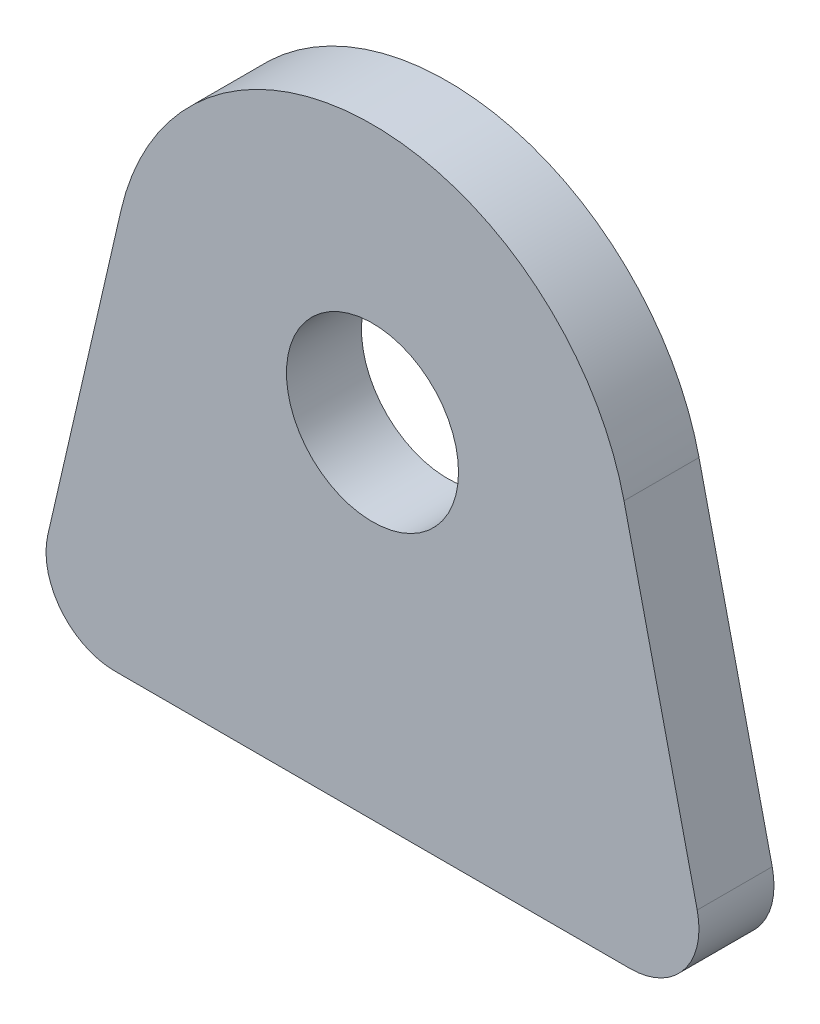
ISO-10303-21;
HEADER;
FILE_DESCRIPTION(('STEP AP214'),'2;1');
FILE_NAME('part.step','',(''),(''),'','','');
FILE_SCHEMA(('AUTOMOTIVE_DESIGN { 1 0 10303 214 1 1 1 1 }'));
ENDSEC;
DATA;
#1=APPLICATION_CONTEXT('core data for automotive mechanical design processes');
#2=APPLICATION_PROTOCOL_DEFINITION('international standard','automotive_design',2000,#1);
#3=PRODUCT_CONTEXT('',#1,'mechanical');
#4=PRODUCT('Part','Part','',(#3));
#5=PRODUCT_RELATED_PRODUCT_CATEGORY('part','',(#4));
#6=PRODUCT_DEFINITION_FORMATION('','',#4);
#7=PRODUCT_DEFINITION_CONTEXT('part definition',#1,'design');
#8=PRODUCT_DEFINITION('design','',#6,#7);
#9=PRODUCT_DEFINITION_SHAPE('','',#8);
#10=(LENGTH_UNIT() NAMED_UNIT(*) SI_UNIT(.MILLI.,.METRE.));
#11=(NAMED_UNIT(*) PLANE_ANGLE_UNIT() SI_UNIT($,.RADIAN.));
#12=(NAMED_UNIT(*) SI_UNIT($,.STERADIAN.) SOLID_ANGLE_UNIT());
#13=UNCERTAINTY_MEASURE_WITH_UNIT(LENGTH_MEASURE(1.E-05),#10,'distance_accuracy_value','');
#14=(GEOMETRIC_REPRESENTATION_CONTEXT(3) GLOBAL_UNCERTAINTY_ASSIGNED_CONTEXT((#13)) GLOBAL_UNIT_ASSIGNED_CONTEXT((#10,
#11,#12)) REPRESENTATION_CONTEXT('',''));
#15=CARTESIAN_POINT('',(0.,0.,0.));
#16=DIRECTION('',(0.,0.,1.));
#17=DIRECTION('',(1.,0.,0.));
#18=AXIS2_PLACEMENT_3D('',#15,#16,#17);
#19=CARTESIAN_POINT('',(-9.50836970439796,2.54,1.3843));
#20=DIRECTION('',(0.,0.,1.));
#21=DIRECTION('',(1.,0.,0.));
#22=AXIS2_PLACEMENT_3D('',#19,#20,#21);
#23=PLANE('',#22);
#24=CARTESIAN_POINT('',(-9.50836970439796,2.54,1.3843));
#25=DIRECTION('',(0.,0.,1.));
#26=DIRECTION('',(1.,0.,0.));
#27=AXIS2_PLACEMENT_3D('',#24,#25,#26);
#28=CIRCLE('',#27,2.54);
#29=CARTESIAN_POINT('',(-11.9835462130497,3.11017650865179,1.3843));
#30=VERTEX_POINT('',#29);
#31=CARTESIAN_POINT('',(-9.50836970439796,0.,1.3843));
#32=VERTEX_POINT('',#31);
#33=EDGE_CURVE('E129',#30,#32,#28,.T.);
#34=ORIENTED_EDGE('',*,*,#33,.T.);
#35=DIRECTION('',(1.,0.,0.));
#36=VECTOR('',#35,1.);
#37=CARTESIAN_POINT('',(-9.50836970439796,0.,1.3843));
#38=LINE('',#37,#36);
#39=CARTESIAN_POINT('',(9.50836970439796,0.,1.3843));
#40=VERTEX_POINT('',#39);
#41=EDGE_CURVE('E87',#32,#40,#38,.T.);
#42=ORIENTED_EDGE('',*,*,#41,.T.);
#43=CARTESIAN_POINT('',(9.50836970439796,2.54,1.3843));
#44=DIRECTION('',(0.,0.,1.));
#45=DIRECTION('',(1.,0.,0.));
#46=AXIS2_PLACEMENT_3D('',#43,#44,#45);
#47=CIRCLE('',#46,2.54);
#48=CARTESIAN_POINT('',(11.9835462130497,3.11017650865179,1.3843));
#49=VERTEX_POINT('',#48);
#50=EDGE_CURVE('E100',#40,#49,#47,.T.);
#51=ORIENTED_EDGE('',*,*,#50,.T.);
#52=DIRECTION('',(-0.22447894041409,0.97447894041409,0.));
#53=VECTOR('',#52,1.);
#54=CARTESIAN_POINT('',(9.28191190744421,14.8381619074442,1.3843));
#55=LINE('',#54,#53);
#56=CARTESIAN_POINT('',(9.28191190744421,14.8381619074442,1.3843));
#57=VERTEX_POINT('',#56);
#58=EDGE_CURVE('E94',#49,#57,#55,.T.);
#59=ORIENTED_EDGE('',*,*,#58,.T.);
#60=CARTESIAN_POINT('',(0.,12.7,1.3843));
#61=DIRECTION('',(0.,0.,1.));
#62=DIRECTION('',(1.,0.,0.));
#63=AXIS2_PLACEMENT_3D('',#60,#61,#62);
#64=CIRCLE('',#63,9.525);
#65=CARTESIAN_POINT('',(-9.28191190744421,14.8381619074442,1.3843));
#66=VERTEX_POINT('',#65);
#67=EDGE_CURVE('E98',#57,#66,#64,.T.);
#68=ORIENTED_EDGE('',*,*,#67,.T.);
#69=DIRECTION('',(-0.22447894041409,-0.97447894041409,0.));
#70=VECTOR('',#69,1.);
#71=CARTESIAN_POINT('',(-9.28191190744421,14.8381619074442,1.3843));
#72=LINE('',#71,#70);
#73=EDGE_CURVE('E50',#66,#30,#72,.T.);
#74=ORIENTED_EDGE('',*,*,#73,.T.);
#75=EDGE_LOOP('',(#34,#42,#51,#59,#68,#74));
#76=FACE_BOUND('',#75,.T.);
#77=CARTESIAN_POINT('',(0.,12.7,1.3843));
#78=DIRECTION('',(0.,0.,1.));
#79=DIRECTION('',(1.,0.,0.));
#80=AXIS2_PLACEMENT_3D('',#77,#78,#79);
#81=CIRCLE('',#80,3.175);
#82=CARTESIAN_POINT('',(3.175,12.7,1.3843));
#83=VERTEX_POINT('',#82);
#84=EDGE_CURVE('E122',#83,#83,#81,.T.);
#85=ORIENTED_EDGE('',*,*,#84,.F.);
#86=EDGE_LOOP('',(#85));
#87=FACE_BOUND('',#86,.T.);
#88=ADVANCED_FACE('F33',(#76,#87),#23,.T.);
#89=CARTESIAN_POINT('',(-9.50836970439796,2.54,-1.3843));
#90=DIRECTION('',(0.,0.,1.));
#91=DIRECTION('',(1.,0.,0.));
#92=AXIS2_PLACEMENT_3D('',#89,#90,#91);
#93=PLANE('',#92);
#94=CARTESIAN_POINT('',(-9.50836970439796,2.54,-1.3843));
#95=DIRECTION('',(0.,0.,1.));
#96=DIRECTION('',(1.,0.,0.));
#97=AXIS2_PLACEMENT_3D('',#94,#95,#96);
#98=CIRCLE('',#97,2.54);
#99=CARTESIAN_POINT('',(-11.9835462130497,3.11017650865179,-1.3843));
#100=VERTEX_POINT('',#99);
#101=CARTESIAN_POINT('',(-9.50836970439796,0.,-1.3843));
#102=VERTEX_POINT('',#101);
#103=EDGE_CURVE('E118',#100,#102,#98,.T.);
#104=ORIENTED_EDGE('',*,*,#103,.F.);
#105=DIRECTION('',(-0.22447894041409,-0.97447894041409,0.));
#106=VECTOR('',#105,1.);
#107=CARTESIAN_POINT('',(-9.28191190744421,14.8381619074442,-1.3843));
#108=LINE('',#107,#106);
#109=CARTESIAN_POINT('',(-9.28191190744421,14.8381619074442,-1.3843));
#110=VERTEX_POINT('',#109);
#111=EDGE_CURVE('E79',#110,#100,#108,.T.);
#112=ORIENTED_EDGE('',*,*,#111,.F.);
#113=CARTESIAN_POINT('',(0.,12.7,-1.3843));
#114=DIRECTION('',(0.,0.,1.));
#115=DIRECTION('',(1.,0.,0.));
#116=AXIS2_PLACEMENT_3D('',#113,#114,#115);
#117=CIRCLE('',#116,9.525);
#118=CARTESIAN_POINT('',(9.28191190744421,14.8381619074442,-1.3843));
#119=VERTEX_POINT('',#118);
#120=EDGE_CURVE('E73',#119,#110,#117,.T.);
#121=ORIENTED_EDGE('',*,*,#120,.F.);
#122=DIRECTION('',(-0.22447894041409,0.97447894041409,0.));
#123=VECTOR('',#122,1.);
#124=CARTESIAN_POINT('',(9.28191190744421,14.8381619074442,-1.3843));
#125=LINE('',#124,#123);
#126=CARTESIAN_POINT('',(11.9835462130497,3.11017650865179,-1.3843));
#127=VERTEX_POINT('',#126);
#128=EDGE_CURVE('E108',#127,#119,#125,.T.);
#129=ORIENTED_EDGE('',*,*,#128,.F.);
#130=CARTESIAN_POINT('',(9.50836970439796,2.54,-1.3843));
#131=DIRECTION('',(0.,0.,1.));
#132=DIRECTION('',(1.,0.,0.));
#133=AXIS2_PLACEMENT_3D('',#130,#131,#132);
#134=CIRCLE('',#133,2.54);
#135=CARTESIAN_POINT('',(9.50836970439796,0.,-1.3843));
#136=VERTEX_POINT('',#135);
#137=EDGE_CURVE('E124',#136,#127,#134,.T.);
#138=ORIENTED_EDGE('',*,*,#137,.F.);
#139=DIRECTION('',(1.,0.,0.));
#140=VECTOR('',#139,1.);
#141=CARTESIAN_POINT('',(-9.50836970439796,0.,-1.3843));
#142=LINE('',#141,#140);
#143=EDGE_CURVE('E121',#102,#136,#142,.T.);
#144=ORIENTED_EDGE('',*,*,#143,.F.);
#145=EDGE_LOOP('',(#104,#112,#121,#129,#138,#144));
#146=FACE_BOUND('',#145,.T.);
#147=CARTESIAN_POINT('',(0.,12.7,-1.3843));
#148=DIRECTION('',(0.,0.,1.));
#149=DIRECTION('',(1.,0.,0.));
#150=AXIS2_PLACEMENT_3D('',#147,#148,#149);
#151=CIRCLE('',#150,3.175);
#152=CARTESIAN_POINT('',(3.175,12.7,-1.3843));
#153=VERTEX_POINT('',#152);
#154=EDGE_CURVE('E222',#153,#153,#151,.T.);
#155=ORIENTED_EDGE('',*,*,#154,.T.);
#156=EDGE_LOOP('',(#155));
#157=FACE_BOUND('',#156,.T.);
#158=ADVANCED_FACE('F138',(#146,#157),#93,.F.);
#159=CARTESIAN_POINT('',(-9.50836970439796,2.54,1.3843));
#160=DIRECTION('',(0.,0.,-1.));
#161=DIRECTION('',(-1.,0.,0.));
#162=AXIS2_PLACEMENT_3D('',#159,#160,#161);
#163=CYLINDRICAL_SURFACE('',#162,2.54);
#164=ORIENTED_EDGE('',*,*,#103,.T.);
#165=DIRECTION('',(0.,0.,-1.));
#166=VECTOR('',#165,1.);
#167=CARTESIAN_POINT('',(-9.50836970439796,0.,1.3843));
#168=LINE('',#167,#166);
#169=EDGE_CURVE('E11',#32,#102,#168,.T.);
#170=ORIENTED_EDGE('',*,*,#169,.F.);
#171=ORIENTED_EDGE('',*,*,#33,.F.);
#172=DIRECTION('',(0.,0.,-1.));
#173=VECTOR('',#172,1.);
#174=CARTESIAN_POINT('',(-11.9835462130497,3.11017650865179,1.3843));
#175=LINE('',#174,#173);
#176=EDGE_CURVE('E114',#30,#100,#175,.T.);
#177=ORIENTED_EDGE('',*,*,#176,.T.);
#178=EDGE_LOOP('',(#164,#170,#171,#177));
#179=FACE_BOUND('',#178,.T.);
#180=ADVANCED_FACE('F35',(#179),#163,.T.);
#181=CARTESIAN_POINT('',(-9.50836970439796,0.,1.3843));
#182=DIRECTION('',(0.,1.,0.));
#183=DIRECTION('',(0.,0.,1.));
#184=AXIS2_PLACEMENT_3D('',#181,#182,#183);
#185=PLANE('',#184);
#186=ORIENTED_EDGE('',*,*,#143,.T.);
#187=DIRECTION('',(0.,0.,-1.));
#188=VECTOR('',#187,1.);
#189=CARTESIAN_POINT('',(9.50836970439796,0.,1.3843));
#190=LINE('',#189,#188);
#191=EDGE_CURVE('E42',#40,#136,#190,.T.);
#192=ORIENTED_EDGE('',*,*,#191,.F.);
#193=ORIENTED_EDGE('',*,*,#41,.F.);
#194=ORIENTED_EDGE('',*,*,#169,.T.);
#195=EDGE_LOOP('',(#186,#192,#193,#194));
#196=FACE_BOUND('',#195,.T.);
#197=ADVANCED_FACE('F163',(#196),#185,.F.);
#198=CARTESIAN_POINT('',(9.50836970439796,2.54,1.3843));
#199=DIRECTION('',(0.,0.,-1.));
#200=DIRECTION('',(-1.,0.,0.));
#201=AXIS2_PLACEMENT_3D('',#198,#199,#200);
#202=CYLINDRICAL_SURFACE('',#201,2.54);
#203=ORIENTED_EDGE('',*,*,#137,.T.);
#204=DIRECTION('',(0.,0.,-1.));
#205=VECTOR('',#204,1.);
#206=CARTESIAN_POINT('',(11.9835462130497,3.11017650865179,1.3843));
#207=LINE('',#206,#205);
#208=EDGE_CURVE('E109',#49,#127,#207,.T.);
#209=ORIENTED_EDGE('',*,*,#208,.F.);
#210=ORIENTED_EDGE('',*,*,#50,.F.);
#211=ORIENTED_EDGE('',*,*,#191,.T.);
#212=EDGE_LOOP('',(#203,#209,#210,#211));
#213=FACE_BOUND('',#212,.T.);
#214=ADVANCED_FACE('F135',(#213),#202,.T.);
#215=CARTESIAN_POINT('',(9.28191190744421,14.8381619074442,1.3843));
#216=DIRECTION('',(-0.97447894041409,-0.22447894041409,0.));
#217=DIRECTION('',(0.22447894041409,-0.97447894041409,0.));
#218=AXIS2_PLACEMENT_3D('',#215,#216,#217);
#219=PLANE('',#218);
#220=ORIENTED_EDGE('',*,*,#128,.T.);
#221=DIRECTION('',(0.,0.,-1.));
#222=VECTOR('',#221,1.);
#223=CARTESIAN_POINT('',(9.28191190744421,14.8381619074442,1.3843));
#224=LINE('',#223,#222);
#225=EDGE_CURVE('E105',#57,#119,#224,.T.);
#226=ORIENTED_EDGE('',*,*,#225,.F.);
#227=ORIENTED_EDGE('',*,*,#58,.F.);
#228=ORIENTED_EDGE('',*,*,#208,.T.);
#229=EDGE_LOOP('',(#220,#226,#227,#228));
#230=FACE_BOUND('',#229,.T.);
#231=ADVANCED_FACE('F106',(#230),#219,.F.);
#232=CARTESIAN_POINT('',(0.,12.7,1.3843));
#233=DIRECTION('',(0.,0.,-1.));
#234=DIRECTION('',(-1.,0.,0.));
#235=AXIS2_PLACEMENT_3D('',#232,#233,#234);
#236=CYLINDRICAL_SURFACE('',#235,9.525);
#237=ORIENTED_EDGE('',*,*,#120,.T.);
#238=DIRECTION('',(0.,0.,-1.));
#239=VECTOR('',#238,1.);
#240=CARTESIAN_POINT('',(-9.28191190744421,14.8381619074442,1.3843));
#241=LINE('',#240,#239);
#242=EDGE_CURVE('E110',#66,#110,#241,.T.);
#243=ORIENTED_EDGE('',*,*,#242,.F.);
#244=ORIENTED_EDGE('',*,*,#67,.F.);
#245=ORIENTED_EDGE('',*,*,#225,.T.);
#246=EDGE_LOOP('',(#237,#243,#244,#245));
#247=FACE_BOUND('',#246,.T.);
#248=ADVANCED_FACE('F112',(#247),#236,.T.);
#249=CARTESIAN_POINT('',(-9.28191190744421,14.8381619074442,1.3843));
#250=DIRECTION('',(0.97447894041409,-0.22447894041409,0.));
#251=DIRECTION('',(0.22447894041409,0.97447894041409,0.));
#252=AXIS2_PLACEMENT_3D('',#249,#250,#251);
#253=PLANE('',#252);
#254=ORIENTED_EDGE('',*,*,#111,.T.);
#255=ORIENTED_EDGE('',*,*,#176,.F.);
#256=ORIENTED_EDGE('',*,*,#73,.F.);
#257=ORIENTED_EDGE('',*,*,#242,.T.);
#258=EDGE_LOOP('',(#254,#255,#256,#257));
#259=FACE_BOUND('',#258,.T.);
#260=ADVANCED_FACE('F143',(#259),#253,.F.);
#261=CARTESIAN_POINT('',(0.,12.7,1.3843));
#262=DIRECTION('',(0.,0.,-1.));
#263=DIRECTION('',(-1.,0.,0.));
#264=AXIS2_PLACEMENT_3D('',#261,#262,#263);
#265=CYLINDRICAL_SURFACE('',#264,3.175);
#266=ORIENTED_EDGE('',*,*,#84,.T.);
#267=EDGE_LOOP('',(#266));
#268=FACE_BOUND('',#267,.T.);
#269=ORIENTED_EDGE('',*,*,#154,.F.);
#270=EDGE_LOOP('',(#269));
#271=FACE_BOUND('',#270,.T.);
#272=ADVANCED_FACE('F145',(#268,#271),#265,.F.);
#273=CLOSED_SHELL('',(#88,#158,#180,#197,#214,#231,#248,#260,#272));
#274=MANIFOLD_SOLID_BREP('B2',#273);
#275=ADVANCED_BREP_SHAPE_REPRESENTATION('',(#18,#274),#14);
#276=SHAPE_DEFINITION_REPRESENTATION(#9,#275);
ENDSEC;
END-ISO-10303-21;
